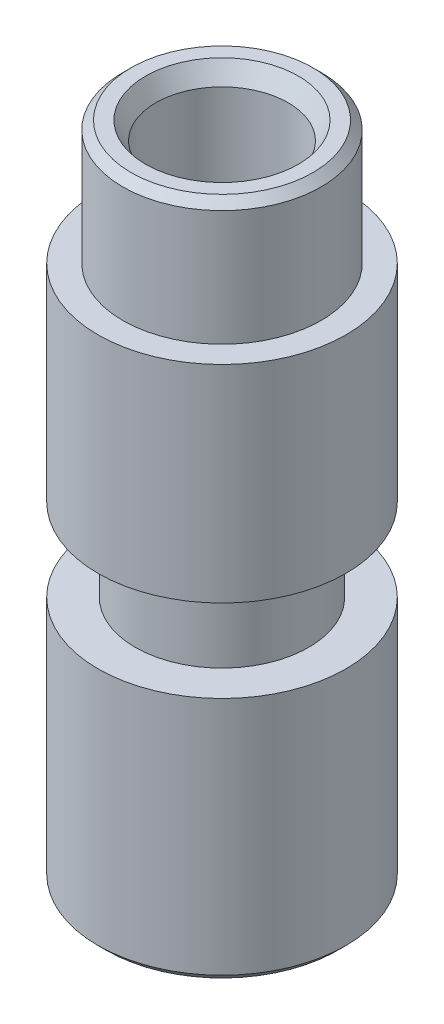
ISO-10303-21;
HEADER;
FILE_DESCRIPTION(('STEP AP214'),'2;1');
FILE_NAME('part.step','',(''),(''),'','','');
FILE_SCHEMA(('AUTOMOTIVE_DESIGN { 1 0 10303 214 1 1 1 1 }'));
ENDSEC;
DATA;
#1=APPLICATION_CONTEXT('core data for automotive mechanical design processes');
#2=APPLICATION_PROTOCOL_DEFINITION('international standard','automotive_design',2000,#1);
#3=PRODUCT_CONTEXT('',#1,'mechanical');
#4=PRODUCT('Part','Part','',(#3));
#5=PRODUCT_RELATED_PRODUCT_CATEGORY('part','',(#4));
#6=PRODUCT_DEFINITION_FORMATION('','',#4);
#7=PRODUCT_DEFINITION_CONTEXT('part definition',#1,'design');
#8=PRODUCT_DEFINITION('design','',#6,#7);
#9=PRODUCT_DEFINITION_SHAPE('','',#8);
#10=(LENGTH_UNIT() NAMED_UNIT(*) SI_UNIT(.MILLI.,.METRE.));
#11=(NAMED_UNIT(*) PLANE_ANGLE_UNIT() SI_UNIT($,.RADIAN.));
#12=(NAMED_UNIT(*) SI_UNIT($,.STERADIAN.) SOLID_ANGLE_UNIT());
#13=UNCERTAINTY_MEASURE_WITH_UNIT(LENGTH_MEASURE(1.E-05),#10,'distance_accuracy_value','');
#14=(GEOMETRIC_REPRESENTATION_CONTEXT(3) GLOBAL_UNCERTAINTY_ASSIGNED_CONTEXT((#13)) GLOBAL_UNIT_ASSIGNED_CONTEXT((#10,
#11,#12)) REPRESENTATION_CONTEXT('',''));
#15=CARTESIAN_POINT('',(0.,0.,0.));
#16=DIRECTION('',(0.,0.,1.));
#17=DIRECTION('',(1.,0.,0.));
#18=AXIS2_PLACEMENT_3D('',#15,#16,#17);
#19=CARTESIAN_POINT('',(0.,13.,0.));
#20=DIRECTION('',(0.,1.,0.));
#21=DIRECTION('',(0.,0.,1.));
#22=AXIS2_PLACEMENT_3D('',#19,#20,#21);
#23=PLANE('',#22);
#24=CARTESIAN_POINT('',(0.,13.,0.));
#25=DIRECTION('',(0.,1.,0.));
#26=DIRECTION('',(0.,0.,1.));
#27=AXIS2_PLACEMENT_3D('',#24,#25,#26);
#28=CIRCLE('',#27,3.);
#29=CARTESIAN_POINT('',(0.,13.,3.));
#30=VERTEX_POINT('',#29);
#31=EDGE_CURVE('E67',#30,#30,#28,.T.);
#32=ORIENTED_EDGE('',*,*,#31,.T.);
#33=EDGE_LOOP('',(#32));
#34=FACE_BOUND('',#33,.T.);
#35=CARTESIAN_POINT('',(0.,13.,0.));
#36=DIRECTION('',(0.,1.,0.));
#37=DIRECTION('',(0.,0.,1.));
#38=AXIS2_PLACEMENT_3D('',#35,#36,#37);
#39=CIRCLE('',#38,2.4);
#40=CARTESIAN_POINT('',(0.,13.,2.4));
#41=VERTEX_POINT('',#40);
#42=EDGE_CURVE('E78',#41,#41,#39,.T.);
#43=ORIENTED_EDGE('',*,*,#42,.F.);
#44=EDGE_LOOP('',(#43));
#45=FACE_BOUND('',#44,.T.);
#46=ADVANCED_FACE('F34',(#34,#45),#23,.T.);
#47=CARTESIAN_POINT('',(0.,6.,0.));
#48=DIRECTION('',(0.,1.,0.));
#49=DIRECTION('',(0.,0.,1.));
#50=AXIS2_PLACEMENT_3D('',#47,#48,#49);
#51=PLANE('',#50);
#52=CARTESIAN_POINT('',(0.,6.,0.));
#53=DIRECTION('',(0.,1.,0.));
#54=DIRECTION('',(0.,0.,1.));
#55=AXIS2_PLACEMENT_3D('',#52,#53,#54);
#56=CIRCLE('',#55,3.);
#57=CARTESIAN_POINT('',(0.,6.,3.));
#58=VERTEX_POINT('',#57);
#59=EDGE_CURVE('E60',#58,#58,#56,.T.);
#60=ORIENTED_EDGE('',*,*,#59,.T.);
#61=EDGE_LOOP('',(#60));
#62=FACE_BOUND('',#61,.T.);
#63=CARTESIAN_POINT('',(0.,6.,0.));
#64=DIRECTION('',(0.,1.,0.));
#65=DIRECTION('',(0.,0.,1.));
#66=AXIS2_PLACEMENT_3D('',#63,#64,#65);
#67=CIRCLE('',#66,2.1);
#68=CARTESIAN_POINT('',(0.,6.,2.1));
#69=VERTEX_POINT('',#68);
#70=EDGE_CURVE('E64',#69,#69,#67,.T.);
#71=ORIENTED_EDGE('',*,*,#70,.F.);
#72=EDGE_LOOP('',(#71));
#73=FACE_BOUND('',#72,.T.);
#74=ADVANCED_FACE('F85',(#62,#73),#51,.T.);
#75=CARTESIAN_POINT('',(0.,6.,0.));
#76=DIRECTION('',(0.,-1.,0.));
#77=DIRECTION('',(0.,0.,-1.));
#78=AXIS2_PLACEMENT_3D('',#75,#76,#77);
#79=CYLINDRICAL_SURFACE('',#78,3.);
#80=CARTESIAN_POINT('',(0.,0.2,0.));
#81=DIRECTION('',(0.,1.,0.));
#82=DIRECTION('',(0.,0.,1.));
#83=AXIS2_PLACEMENT_3D('',#80,#81,#82);
#84=CIRCLE('',#83,3.);
#85=CARTESIAN_POINT('',(0.,0.2,3.));
#86=VERTEX_POINT('',#85);
#87=EDGE_CURVE('E49',#86,#86,#84,.T.);
#88=ORIENTED_EDGE('',*,*,#87,.T.);
#89=EDGE_LOOP('',(#88));
#90=FACE_BOUND('',#89,.T.);
#91=ORIENTED_EDGE('',*,*,#59,.F.);
#92=EDGE_LOOP('',(#91));
#93=FACE_BOUND('',#92,.T.);
#94=ADVANCED_FACE('F91',(#90,#93),#79,.T.);
#95=CARTESIAN_POINT('',(0.,0.,0.));
#96=DIRECTION('',(0.,1.,0.));
#97=DIRECTION('',(0.,0.,1.));
#98=AXIS2_PLACEMENT_3D('',#95,#96,#97);
#99=PLANE('',#98);
#100=CARTESIAN_POINT('',(0.,0.,0.));
#101=DIRECTION('',(0.,1.,0.));
#102=DIRECTION('',(0.,0.,1.));
#103=AXIS2_PLACEMENT_3D('',#100,#101,#102);
#104=CIRCLE('',#103,2.8);
#105=CARTESIAN_POINT('',(0.,0.,2.8));
#106=VERTEX_POINT('',#105);
#107=EDGE_CURVE('E45',#106,#106,#104,.F.);
#108=ORIENTED_EDGE('',*,*,#107,.T.);
#109=EDGE_LOOP('',(#108));
#110=FACE_BOUND('',#109,.T.);
#111=CARTESIAN_POINT('',(0.,0.,0.));
#112=DIRECTION('',(0.,1.,0.));
#113=DIRECTION('',(0.,0.,1.));
#114=AXIS2_PLACEMENT_3D('',#111,#112,#113);
#115=CIRCLE('',#114,1.6);
#116=CARTESIAN_POINT('',(0.,0.,1.6));
#117=VERTEX_POINT('',#116);
#118=EDGE_CURVE('E73',#117,#117,#115,.T.);
#119=ORIENTED_EDGE('',*,*,#118,.T.);
#120=EDGE_LOOP('',(#119));
#121=FACE_BOUND('',#120,.T.);
#122=ADVANCED_FACE('F108',(#110,#121),#99,.F.);
#123=CARTESIAN_POINT('',(0.,8.,0.));
#124=DIRECTION('',(0.,-1.,0.));
#125=DIRECTION('',(0.,0.,-1.));
#126=AXIS2_PLACEMENT_3D('',#123,#124,#125);
#127=CYLINDRICAL_SURFACE('',#126,2.1);
#128=CARTESIAN_POINT('',(0.,8.,0.));
#129=DIRECTION('',(0.,1.,0.));
#130=DIRECTION('',(0.,0.,1.));
#131=AXIS2_PLACEMENT_3D('',#128,#129,#130);
#132=CIRCLE('',#131,2.1);
#133=CARTESIAN_POINT('',(0.,8.,2.1));
#134=VERTEX_POINT('',#133);
#135=EDGE_CURVE('E63',#134,#134,#132,.T.);
#136=ORIENTED_EDGE('',*,*,#135,.F.);
#137=EDGE_LOOP('',(#136));
#138=FACE_BOUND('',#137,.T.);
#139=ORIENTED_EDGE('',*,*,#70,.T.);
#140=EDGE_LOOP('',(#139));
#141=FACE_BOUND('',#140,.T.);
#142=ADVANCED_FACE('F102',(#138,#141),#127,.T.);
#143=CARTESIAN_POINT('',(0.,8.,0.));
#144=DIRECTION('',(0.,1.,0.));
#145=DIRECTION('',(0.,0.,1.));
#146=AXIS2_PLACEMENT_3D('',#143,#144,#145);
#147=PLANE('',#146);
#148=CARTESIAN_POINT('',(0.,8.,0.));
#149=DIRECTION('',(0.,1.,0.));
#150=DIRECTION('',(0.,0.,1.));
#151=AXIS2_PLACEMENT_3D('',#148,#149,#150);
#152=CIRCLE('',#151,3.);
#153=CARTESIAN_POINT('',(0.,8.,3.));
#154=VERTEX_POINT('',#153);
#155=EDGE_CURVE('E70',#154,#154,#152,.T.);
#156=ORIENTED_EDGE('',*,*,#155,.F.);
#157=EDGE_LOOP('',(#156));
#158=FACE_BOUND('',#157,.T.);
#159=ORIENTED_EDGE('',*,*,#135,.T.);
#160=EDGE_LOOP('',(#159));
#161=FACE_BOUND('',#160,.T.);
#162=ADVANCED_FACE('F98',(#158,#161),#147,.F.);
#163=CARTESIAN_POINT('',(0.,13.,0.));
#164=DIRECTION('',(0.,-1.,0.));
#165=DIRECTION('',(0.,0.,-1.));
#166=AXIS2_PLACEMENT_3D('',#163,#164,#165);
#167=CYLINDRICAL_SURFACE('',#166,3.);
#168=ORIENTED_EDGE('',*,*,#31,.F.);
#169=EDGE_LOOP('',(#168));
#170=FACE_BOUND('',#169,.T.);
#171=ORIENTED_EDGE('',*,*,#155,.T.);
#172=EDGE_LOOP('',(#171));
#173=FACE_BOUND('',#172,.T.);
#174=ADVANCED_FACE('F101',(#170,#173),#167,.T.);
#175=CARTESIAN_POINT('',(0.,0.,0.));
#176=DIRECTION('',(0.,1.,0.));
#177=DIRECTION('',(0.,0.,1.));
#178=AXIS2_PLACEMENT_3D('',#175,#176,#177);
#179=CYLINDRICAL_SURFACE('',#178,1.6);
#180=CARTESIAN_POINT('',(0.,15.5669872981078,0.));
#181=DIRECTION('',(0.,1.,0.));
#182=DIRECTION('',(0.,0.,1.));
#183=AXIS2_PLACEMENT_3D('',#180,#181,#182);
#184=CIRCLE('',#183,1.6);
#185=CARTESIAN_POINT('',(0.,15.5669872981078,1.6));
#186=VERTEX_POINT('',#185);
#187=EDGE_CURVE('E41',#186,#186,#184,.T.);
#188=ORIENTED_EDGE('',*,*,#187,.T.);
#189=EDGE_LOOP('',(#188));
#190=FACE_BOUND('',#189,.T.);
#191=ORIENTED_EDGE('',*,*,#118,.F.);
#192=EDGE_LOOP('',(#191));
#193=FACE_BOUND('',#192,.T.);
#194=ADVANCED_FACE('F96',(#190,#193),#179,.F.);
#195=CARTESIAN_POINT('',(0.,16.,0.));
#196=DIRECTION('',(0.,1.,0.));
#197=DIRECTION('',(0.,0.,1.));
#198=AXIS2_PLACEMENT_3D('',#195,#196,#197);
#199=PLANE('',#198);
#200=CARTESIAN_POINT('',(0.,16.,0.));
#201=DIRECTION('',(0.,1.,0.));
#202=DIRECTION('',(0.,0.,1.));
#203=AXIS2_PLACEMENT_3D('',#200,#201,#202);
#204=CIRCLE('',#203,1.85);
#205=CARTESIAN_POINT('',(0.,16.,1.85));
#206=VERTEX_POINT('',#205);
#207=EDGE_CURVE('E10',#206,#206,#204,.F.);
#208=ORIENTED_EDGE('',*,*,#207,.T.);
#209=EDGE_LOOP('',(#208));
#210=FACE_BOUND('',#209,.T.);
#211=CARTESIAN_POINT('',(0.,16.,0.));
#212=DIRECTION('',(0.,1.,0.));
#213=DIRECTION('',(0.,0.,1.));
#214=AXIS2_PLACEMENT_3D('',#211,#212,#213);
#215=CIRCLE('',#214,2.2);
#216=CARTESIAN_POINT('',(0.,16.,2.2));
#217=VERTEX_POINT('',#216);
#218=EDGE_CURVE('E57',#217,#217,#215,.T.);
#219=ORIENTED_EDGE('',*,*,#218,.T.);
#220=EDGE_LOOP('',(#219));
#221=FACE_BOUND('',#220,.T.);
#222=ADVANCED_FACE('F139',(#210,#221),#199,.T.);
#223=CARTESIAN_POINT('',(0.,16.,0.));
#224=DIRECTION('',(0.,-1.,0.));
#225=DIRECTION('',(0.,0.,-1.));
#226=AXIS2_PLACEMENT_3D('',#223,#224,#225);
#227=CYLINDRICAL_SURFACE('',#226,2.4);
#228=CARTESIAN_POINT('',(0.,15.8,0.));
#229=DIRECTION('',(0.,1.,0.));
#230=DIRECTION('',(0.,0.,1.));
#231=AXIS2_PLACEMENT_3D('',#228,#229,#230);
#232=CIRCLE('',#231,2.4);
#233=CARTESIAN_POINT('',(0.,15.8,2.4));
#234=VERTEX_POINT('',#233);
#235=EDGE_CURVE('E54',#234,#234,#232,.F.);
#236=ORIENTED_EDGE('',*,*,#235,.T.);
#237=EDGE_LOOP('',(#236));
#238=FACE_BOUND('',#237,.T.);
#239=ORIENTED_EDGE('',*,*,#42,.T.);
#240=EDGE_LOOP('',(#239));
#241=FACE_BOUND('',#240,.T.);
#242=ADVANCED_FACE('F82',(#238,#241),#227,.T.);
#243=CARTESIAN_POINT('',(0.,16.,0.));
#244=DIRECTION('',(0.,-1.,0.));
#245=DIRECTION('',(0.,0.,-1.));
#246=AXIS2_PLACEMENT_3D('',#243,#244,#245);
#247=CONICAL_SURFACE('',#246,2.2,0.785398163397441);
#248=ORIENTED_EDGE('',*,*,#235,.F.);
#249=EDGE_LOOP('',(#248));
#250=FACE_BOUND('',#249,.T.);
#251=ORIENTED_EDGE('',*,*,#218,.F.);
#252=EDGE_LOOP('',(#251));
#253=FACE_BOUND('',#252,.T.);
#254=ADVANCED_FACE('F117',(#250,#253),#247,.T.);
#255=CARTESIAN_POINT('',(0.,0.2,0.));
#256=DIRECTION('',(0.,1.,0.));
#257=DIRECTION('',(0.,0.,1.));
#258=AXIS2_PLACEMENT_3D('',#255,#256,#257);
#259=CONICAL_SURFACE('',#258,3.,0.785398163397448);
#260=ORIENTED_EDGE('',*,*,#107,.F.);
#261=EDGE_LOOP('',(#260));
#262=FACE_BOUND('',#261,.T.);
#263=ORIENTED_EDGE('',*,*,#87,.F.);
#264=EDGE_LOOP('',(#263));
#265=FACE_BOUND('',#264,.T.);
#266=ADVANCED_FACE('F119',(#262,#265),#259,.T.);
#267=CARTESIAN_POINT('',(0.,15.5669872981078,0.));
#268=DIRECTION('',(0.,1.,0.));
#269=DIRECTION('',(0.,0.,1.));
#270=AXIS2_PLACEMENT_3D('',#267,#268,#269);
#271=CONICAL_SURFACE('',#270,1.6,0.523598775598298);
#272=ORIENTED_EDGE('',*,*,#207,.F.);
#273=EDGE_LOOP('',(#272));
#274=FACE_BOUND('',#273,.T.);
#275=ORIENTED_EDGE('',*,*,#187,.F.);
#276=EDGE_LOOP('',(#275));
#277=FACE_BOUND('',#276,.T.);
#278=ADVANCED_FACE('F36',(#274,#277),#271,.F.);
#279=CLOSED_SHELL('',(#46,#74,#94,#122,#142,#162,#174,#194,#222,#242,#254,#266,#278));
#280=MANIFOLD_SOLID_BREP('B2',#279);
#281=ADVANCED_BREP_SHAPE_REPRESENTATION('',(#18,#280),#14);
#282=SHAPE_DEFINITION_REPRESENTATION(#9,#281);
ENDSEC;
END-ISO-10303-21;
